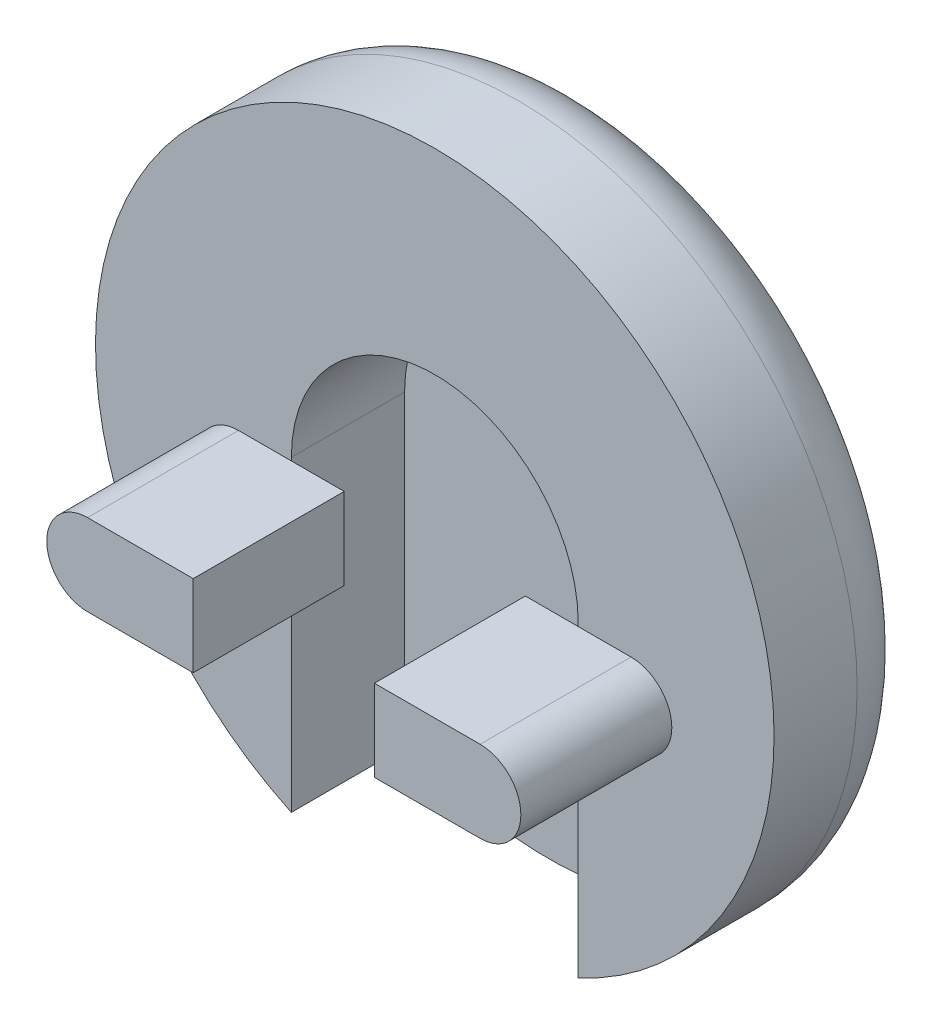
ISO-10303-21;
HEADER;
FILE_DESCRIPTION(('STEP AP214'),'2;1');
FILE_NAME('part.step','',(''),(''),'','','');
FILE_SCHEMA(('AUTOMOTIVE_DESIGN { 1 0 10303 214 1 1 1 1 }'));
ENDSEC;
DATA;
#1=APPLICATION_CONTEXT('core data for automotive mechanical design processes');
#2=APPLICATION_PROTOCOL_DEFINITION('international standard','automotive_design',2000,#1);
#3=PRODUCT_CONTEXT('',#1,'mechanical');
#4=PRODUCT('Part','Part','',(#3));
#5=PRODUCT_RELATED_PRODUCT_CATEGORY('part','',(#4));
#6=PRODUCT_DEFINITION_FORMATION('','',#4);
#7=PRODUCT_DEFINITION_CONTEXT('part definition',#1,'design');
#8=PRODUCT_DEFINITION('design','',#6,#7);
#9=PRODUCT_DEFINITION_SHAPE('','',#8);
#10=(LENGTH_UNIT() NAMED_UNIT(*) SI_UNIT(.MILLI.,.METRE.));
#11=(NAMED_UNIT(*) PLANE_ANGLE_UNIT() SI_UNIT($,.RADIAN.));
#12=(NAMED_UNIT(*) SI_UNIT($,.STERADIAN.) SOLID_ANGLE_UNIT());
#13=UNCERTAINTY_MEASURE_WITH_UNIT(LENGTH_MEASURE(1.E-05),#10,'distance_accuracy_value','');
#14=(GEOMETRIC_REPRESENTATION_CONTEXT(3) GLOBAL_UNCERTAINTY_ASSIGNED_CONTEXT((#13)) GLOBAL_UNIT_ASSIGNED_CONTEXT((#10,
#11,#12)) REPRESENTATION_CONTEXT('',''));
#15=CARTESIAN_POINT('',(0.,0.,0.));
#16=DIRECTION('',(0.,0.,1.));
#17=DIRECTION('',(1.,0.,0.));
#18=AXIS2_PLACEMENT_3D('',#15,#16,#17);
#19=CARTESIAN_POINT('',(0.534641806206758,0.935623160861775,2.54));
#20=DIRECTION('',(0.,0.,1.));
#21=DIRECTION('',(1.,0.,0.));
#22=AXIS2_PLACEMENT_3D('',#19,#20,#21);
#23=PLANE('',#22);
#24=CARTESIAN_POINT('',(3.83664180620676,0.197068843132637,2.54));
#25=DIRECTION('',(0.,0.,1.));
#26=DIRECTION('',(1.,0.,0.));
#27=AXIS2_PLACEMENT_3D('',#24,#25,#26);
#28=CIRCLE('',#27,0.6858);
#29=CARTESIAN_POINT('',(3.83664180620676,-0.488731156867363,2.54));
#30=VERTEX_POINT('',#29);
#31=CARTESIAN_POINT('',(3.83664180620676,0.882868843132637,2.54));
#32=VERTEX_POINT('',#31);
#33=EDGE_CURVE('E299',#30,#32,#28,.T.);
#34=ORIENTED_EDGE('',*,*,#33,.F.);
#35=DIRECTION('',(1.,0.,0.));
#36=VECTOR('',#35,1.);
#37=CARTESIAN_POINT('',(2.05864180620676,-0.488731156867363,2.54));
#38=LINE('',#37,#36);
#39=CARTESIAN_POINT('',(2.94764180620676,-0.488731156867363,2.54));
#40=VERTEX_POINT('',#39);
#41=EDGE_CURVE('E300',#40,#30,#38,.T.);
#42=ORIENTED_EDGE('',*,*,#41,.F.);
#43=DIRECTION('',(0.,1.,0.));
#44=VECTOR('',#43,1.);
#45=CARTESIAN_POINT('',(2.94764180620676,0.,2.54));
#46=LINE('',#45,#44);
#47=CARTESIAN_POINT('',(2.94764180620676,-4.23745744263961,2.54));
#48=VERTEX_POINT('',#47);
#49=EDGE_CURVE('E221',#48,#40,#46,.T.);
#50=ORIENTED_EDGE('',*,*,#49,.F.);
#51=CARTESIAN_POINT('',(0.534641806206758,0.935623160861775,2.54));
#52=DIRECTION('',(0.,0.,1.));
#53=DIRECTION('',(1.,0.,0.));
#54=AXIS2_PLACEMENT_3D('',#51,#52,#53);
#55=CIRCLE('',#54,5.70818114028648);
#56=CARTESIAN_POINT('',(-1.87835819379324,-4.23745744263961,2.54));
#57=VERTEX_POINT('',#56);
#58=EDGE_CURVE('E234',#48,#57,#55,.T.);
#59=ORIENTED_EDGE('',*,*,#58,.T.);
#60=DIRECTION('',(0.,1.,0.));
#61=VECTOR('',#60,1.);
#62=CARTESIAN_POINT('',(-1.87835819379324,0.,2.54));
#63=LINE('',#62,#61);
#64=CARTESIAN_POINT('',(-1.87835819379324,-0.48873115686736,2.54));
#65=VERTEX_POINT('',#64);
#66=EDGE_CURVE('E215',#57,#65,#63,.T.);
#67=ORIENTED_EDGE('',*,*,#66,.T.);
#68=DIRECTION('',(1.,0.,0.));
#69=VECTOR('',#68,1.);
#70=CARTESIAN_POINT('',(-2.76735819379324,-0.48873115686736,2.54));
#71=LINE('',#70,#69);
#72=CARTESIAN_POINT('',(-2.76735819379324,-0.48873115686736,2.54));
#73=VERTEX_POINT('',#72);
#74=EDGE_CURVE('E184',#73,#65,#71,.T.);
#75=ORIENTED_EDGE('',*,*,#74,.F.);
#76=CARTESIAN_POINT('',(-2.76735819379324,0.19706884313264,2.54));
#77=DIRECTION('',(0.,0.,1.));
#78=DIRECTION('',(1.,0.,0.));
#79=AXIS2_PLACEMENT_3D('',#76,#77,#78);
#80=CIRCLE('',#79,0.6858);
#81=CARTESIAN_POINT('',(-2.76735819379324,0.88286884313264,2.54));
#82=VERTEX_POINT('',#81);
#83=EDGE_CURVE('E193',#82,#73,#80,.T.);
#84=ORIENTED_EDGE('',*,*,#83,.F.);
#85=DIRECTION('',(-1.,0.,0.));
#86=VECTOR('',#85,1.);
#87=CARTESIAN_POINT('',(-0.989358193793241,0.88286884313264,2.54));
#88=LINE('',#87,#86);
#89=CARTESIAN_POINT('',(-1.87835819379324,0.88286884313264,2.54));
#90=VERTEX_POINT('',#89);
#91=EDGE_CURVE('E194',#90,#82,#88,.T.);
#92=ORIENTED_EDGE('',*,*,#91,.F.);
#93=CARTESIAN_POINT('',(-1.87835819379324,0.935623160861775,2.54));
#94=VERTEX_POINT('',#93);
#95=EDGE_CURVE('E228',#90,#94,#63,.T.);
#96=ORIENTED_EDGE('',*,*,#95,.T.);
#97=CARTESIAN_POINT('',(0.534641806206758,0.935623160861775,2.54));
#98=DIRECTION('',(0.,0.,1.));
#99=DIRECTION('',(1.,0.,0.));
#100=AXIS2_PLACEMENT_3D('',#97,#98,#99);
#101=CIRCLE('',#100,2.413);
#102=CARTESIAN_POINT('',(2.94764180620676,0.935623160861775,2.54));
#103=VERTEX_POINT('',#102);
#104=EDGE_CURVE('E224',#103,#94,#101,.T.);
#105=ORIENTED_EDGE('',*,*,#104,.F.);
#106=CARTESIAN_POINT('',(2.94764180620676,0.882868843132637,2.54));
#107=VERTEX_POINT('',#106);
#108=EDGE_CURVE('E211',#107,#103,#46,.T.);
#109=ORIENTED_EDGE('',*,*,#108,.F.);
#110=DIRECTION('',(-1.,0.,0.));
#111=VECTOR('',#110,1.);
#112=CARTESIAN_POINT('',(2.05864180620676,0.882868843132637,2.54));
#113=LINE('',#112,#111);
#114=EDGE_CURVE('E166',#32,#107,#113,.T.);
#115=ORIENTED_EDGE('',*,*,#114,.F.);
#116=EDGE_LOOP('',(#34,#42,#50,#59,#67,#75,#84,#92,#96,#105,#109,#115));
#117=FACE_BOUND('',#116,.T.);
#118=ADVANCED_FACE('F37',(#117),#23,.T.);
#119=CARTESIAN_POINT('',(0.534641806206758,0.935623160861775,2.54));
#120=DIRECTION('',(0.,0.,-1.));
#121=DIRECTION('',(-1.,0.,0.));
#122=AXIS2_PLACEMENT_3D('',#119,#120,#121);
#123=CYLINDRICAL_SURFACE('',#122,5.70818114028648);
#124=DIRECTION('',(0.,0.,1.));
#125=VECTOR('',#124,1.);
#126=CARTESIAN_POINT('',(2.94764180620676,-4.23745744263961,0.635));
#127=LINE('',#126,#125);
#128=CARTESIAN_POINT('',(2.94764180620676,-4.23745744263961,1.143));
#129=VERTEX_POINT('',#128);
#130=EDGE_CURVE('E232',#129,#48,#127,.T.);
#131=ORIENTED_EDGE('',*,*,#130,.F.);
#132=CARTESIAN_POINT('',(0.534641806206758,0.935623160861775,1.143));
#133=DIRECTION('',(0.,0.,1.));
#134=DIRECTION('',(1.,0.,0.));
#135=AXIS2_PLACEMENT_3D('',#132,#133,#134);
#136=CIRCLE('',#135,5.70818114028648);
#137=CARTESIAN_POINT('',(-1.87835819379324,-4.23745744263961,1.143));
#138=VERTEX_POINT('',#137);
#139=EDGE_CURVE('E244',#129,#138,#136,.T.);
#140=ORIENTED_EDGE('',*,*,#139,.T.);
#141=DIRECTION('',(0.,0.,1.));
#142=VECTOR('',#141,1.);
#143=CARTESIAN_POINT('',(-1.87835819379324,-4.23745744263961,0.635));
#144=LINE('',#143,#142);
#145=EDGE_CURVE('E235',#138,#57,#144,.T.);
#146=ORIENTED_EDGE('',*,*,#145,.T.);
#147=ORIENTED_EDGE('',*,*,#58,.F.);
#148=EDGE_LOOP('',(#131,#140,#146,#147));
#149=FACE_BOUND('',#148,.T.);
#150=ADVANCED_FACE('F281',(#149),#123,.T.);
#151=CARTESIAN_POINT('',(0.534641806206758,0.935623160861775,0.));
#152=DIRECTION('',(0.,0.,1.));
#153=DIRECTION('',(1.,0.,0.));
#154=AXIS2_PLACEMENT_3D('',#151,#152,#153);
#155=PLANE('',#154);
#156=CARTESIAN_POINT('',(0.534641806206758,0.935623160861775,0.));
#157=DIRECTION('',(0.,0.,1.));
#158=DIRECTION('',(1.,0.,0.));
#159=AXIS2_PLACEMENT_3D('',#156,#157,#158);
#160=CIRCLE('',#159,4.56518114028648);
#161=CARTESIAN_POINT('',(5.09982294649324,0.935623160861775,0.));
#162=VERTEX_POINT('',#161);
#163=EDGE_CURVE('E12',#162,#162,#160,.F.);
#164=ORIENTED_EDGE('',*,*,#163,.T.);
#165=EDGE_LOOP('',(#164));
#166=FACE_BOUND('',#165,.T.);
#167=ADVANCED_FACE('F267',(#166),#155,.F.);
#168=CARTESIAN_POINT('',(2.94764180620676,0.,0.635));
#169=DIRECTION('',(1.,0.,0.));
#170=DIRECTION('',(0.,0.,-1.));
#171=AXIS2_PLACEMENT_3D('',#168,#169,#170);
#172=PLANE('',#171);
#173=DIRECTION('',(0.,1.,0.));
#174=VECTOR('',#173,1.);
#175=CARTESIAN_POINT('',(2.94764180620676,0.,0.635));
#176=LINE('',#175,#174);
#177=CARTESIAN_POINT('',(2.94764180620676,-4.10573918148928,0.635));
#178=VERTEX_POINT('',#177);
#179=CARTESIAN_POINT('',(2.94764180620676,0.935623160861775,0.635));
#180=VERTEX_POINT('',#179);
#181=EDGE_CURVE('E212',#178,#180,#176,.T.);
#182=ORIENTED_EDGE('',*,*,#181,.F.);
#183=CARTESIAN_POINT('',(2.94764180620676,-4.10573918148928,0.635));
#184=CARTESIAN_POINT('',(2.94764180620676,-4.12018182209151,0.66125917941811));
#185=CARTESIAN_POINT('',(2.94764180620676,-4.13353671551341,0.688098257732688));
#186=CARTESIAN_POINT('',(2.94764180620676,-4.15796868166917,0.742811190824336));
#187=CARTESIAN_POINT('',(2.94764180620676,-4.16904448195041,0.77068561345363));
#188=CARTESIAN_POINT('',(2.94764180620676,-4.19824182968764,0.854381254054029));
#189=CARTESIAN_POINT('',(2.94764180620676,-4.21297758116857,0.91144603978596));
#190=CARTESIAN_POINT('',(2.94764180620676,-4.22764834976591,0.997813191966427));
#191=CARTESIAN_POINT('',(2.94764180620676,-4.23129961097129,1.02654129878058));
#192=CARTESIAN_POINT('',(2.94764180620676,-4.2362166303214,1.08450513744778));
#193=CARTESIAN_POINT('',(2.94764180620676,-4.23745690795823,1.11374303091327));
#194=CARTESIAN_POINT('',(2.94764180620676,-4.23745744263961,1.143));
#195=B_SPLINE_CURVE_WITH_KNOTS('',3,(#183,#184,#185,#186,#187,#188,#189,#190,#191,#192,#193,
#194),.UNSPECIFIED.,.F.,.F.,(4,2,2,2,2,4),(0.,0.0898473539475477,0.179744735751891,
0.355577383247332,0.442371889098987,0.530078800916125),.UNSPECIFIED.);
#196=EDGE_CURVE('E46',#178,#129,#195,.T.);
#197=ORIENTED_EDGE('',*,*,#196,.T.);
#198=ORIENTED_EDGE('',*,*,#130,.T.);
#199=ORIENTED_EDGE('',*,*,#49,.T.);
#200=EDGE_CURVE('E225',#40,#107,#46,.T.);
#201=ORIENTED_EDGE('',*,*,#200,.T.);
#202=ORIENTED_EDGE('',*,*,#108,.T.);
#203=DIRECTION('',(0.,0.,1.));
#204=VECTOR('',#203,1.);
#205=CARTESIAN_POINT('',(2.94764180620676,0.935623160861775,0.635));
#206=LINE('',#205,#204);
#207=EDGE_CURVE('E220',#180,#103,#206,.T.);
#208=ORIENTED_EDGE('',*,*,#207,.F.);
#209=EDGE_LOOP('',(#182,#197,#198,#199,#201,#202,#208));
#210=FACE_BOUND('',#209,.T.);
#211=ADVANCED_FACE('F258',(#210),#172,.F.);
#212=CARTESIAN_POINT('',(-1.87835819379324,0.,0.635));
#213=DIRECTION('',(1.,0.,0.));
#214=DIRECTION('',(0.,0.,-1.));
#215=AXIS2_PLACEMENT_3D('',#212,#213,#214);
#216=PLANE('',#215);
#217=ORIENTED_EDGE('',*,*,#145,.F.);
#218=CARTESIAN_POINT('',(-1.87835819379324,-4.23745744263961,1.143));
#219=CARTESIAN_POINT('',(-1.87835819379324,-4.23745724658603,1.11303043220782));
#220=CARTESIAN_POINT('',(-1.87835819379324,-4.23615551072581,1.08308027739856));
#221=CARTESIAN_POINT('',(-1.87835819379324,-4.23096878084433,1.02339925972294));
#222=CARTESIAN_POINT('',(-1.87835819379324,-4.22708334417785,0.993668435315366));
#223=CARTESIAN_POINT('',(-1.87835819379324,-4.21180571407471,0.906370099767557));
#224=CARTESIAN_POINT('',(-1.87835819379324,-4.19678805012741,0.849382676705431));
#225=CARTESIAN_POINT('',(-1.87835819379324,-4.16752544589358,0.766801511388969));
#226=CARTESIAN_POINT('',(-1.87835819379324,-4.1567369846728,0.739917797942896));
#227=CARTESIAN_POINT('',(-1.87835819379324,-4.13290588864199,0.686832096109021));
#228=CARTESIAN_POINT('',(-1.87835819379324,-4.11984100155579,0.660640090584266));
#229=CARTESIAN_POINT('',(-1.87835819379324,-4.10573918148948,0.634999999999928));
#230=B_SPLINE_CURVE_WITH_KNOTS('',3,(#218,#219,#220,#221,#222,#223,#224,#225,#226,#227,#228,
#229),.UNSPECIFIED.,.F.,.F.,(4,2,2,2,2,4),(0.,0.0898421493365797,0.179699694591107,
0.355522620942395,0.442349720620996,0.530078784901483),.UNSPECIFIED.);
#231=CARTESIAN_POINT('',(-1.87835819379324,-4.10573918148928,0.635));
#232=VERTEX_POINT('',#231);
#233=EDGE_CURVE('E61',#138,#232,#230,.T.);
#234=ORIENTED_EDGE('',*,*,#233,.T.);
#235=DIRECTION('',(0.,1.,0.));
#236=VECTOR('',#235,1.);
#237=CARTESIAN_POINT('',(-1.87835819379324,0.,0.635));
#238=LINE('',#237,#236);
#239=CARTESIAN_POINT('',(-1.87835819379324,0.935623160861775,0.635));
#240=VERTEX_POINT('',#239);
#241=EDGE_CURVE('E218',#232,#240,#238,.T.);
#242=ORIENTED_EDGE('',*,*,#241,.T.);
#243=DIRECTION('',(0.,0.,1.));
#244=VECTOR('',#243,1.);
#245=CARTESIAN_POINT('',(-1.87835819379324,0.935623160861775,0.635));
#246=LINE('',#245,#244);
#247=EDGE_CURVE('E237',#240,#94,#246,.T.);
#248=ORIENTED_EDGE('',*,*,#247,.T.);
#249=ORIENTED_EDGE('',*,*,#95,.F.);
#250=EDGE_CURVE('E231',#65,#90,#63,.T.);
#251=ORIENTED_EDGE('',*,*,#250,.F.);
#252=ORIENTED_EDGE('',*,*,#66,.F.);
#253=EDGE_LOOP('',(#217,#234,#242,#248,#249,#251,#252));
#254=FACE_BOUND('',#253,.T.);
#255=ADVANCED_FACE('F252',(#254),#216,.T.);
#256=CARTESIAN_POINT('',(0.534641806206758,0.935623160861775,0.635));
#257=DIRECTION('',(0.,0.,1.));
#258=DIRECTION('',(1.,0.,0.));
#259=AXIS2_PLACEMENT_3D('',#256,#257,#258);
#260=CYLINDRICAL_SURFACE('',#259,2.413);
#261=ORIENTED_EDGE('',*,*,#104,.T.);
#262=ORIENTED_EDGE('',*,*,#247,.F.);
#263=CARTESIAN_POINT('',(0.534641806206758,0.935623160861775,0.635));
#264=DIRECTION('',(0.,0.,1.));
#265=DIRECTION('',(1.,0.,0.));
#266=AXIS2_PLACEMENT_3D('',#263,#264,#265);
#267=CIRCLE('',#266,2.413);
#268=EDGE_CURVE('E214',#180,#240,#267,.T.);
#269=ORIENTED_EDGE('',*,*,#268,.F.);
#270=ORIENTED_EDGE('',*,*,#207,.T.);
#271=EDGE_LOOP('',(#261,#262,#269,#270));
#272=FACE_BOUND('',#271,.T.);
#273=ADVANCED_FACE('F257',(#272),#260,.F.);
#274=CARTESIAN_POINT('',(0.,0.,0.635));
#275=DIRECTION('',(0.,0.,1.));
#276=DIRECTION('',(1.,0.,0.));
#277=AXIS2_PLACEMENT_3D('',#274,#275,#276);
#278=PLANE('',#277);
#279=ORIENTED_EDGE('',*,*,#241,.F.);
#280=CARTESIAN_POINT('',(0.534641806206758,0.935623160861775,0.635));
#281=DIRECTION('',(0.,0.,1.));
#282=DIRECTION('',(1.,0.,0.));
#283=AXIS2_PLACEMENT_3D('',#280,#281,#282);
#284=CIRCLE('',#283,5.58908787432039);
#285=EDGE_CURVE('E53',#232,#178,#284,.T.);
#286=ORIENTED_EDGE('',*,*,#285,.T.);
#287=ORIENTED_EDGE('',*,*,#181,.T.);
#288=ORIENTED_EDGE('',*,*,#268,.T.);
#289=EDGE_LOOP('',(#279,#286,#287,#288));
#290=FACE_BOUND('',#289,.T.);
#291=ADVANCED_FACE('F259',(#290),#278,.T.);
#292=CARTESIAN_POINT('',(-2.76735819379324,0.19706884313264,2.54));
#293=DIRECTION('',(0.,0.,1.));
#294=DIRECTION('',(1.,0.,0.));
#295=AXIS2_PLACEMENT_3D('',#292,#293,#294);
#296=PLANE('',#295);
#297=CARTESIAN_POINT('',(-0.989358193793241,-0.48873115686736,2.54));
#298=VERTEX_POINT('',#297);
#299=EDGE_CURVE('E197',#65,#298,#71,.T.);
#300=ORIENTED_EDGE('',*,*,#299,.F.);
#301=ORIENTED_EDGE('',*,*,#250,.T.);
#302=CARTESIAN_POINT('',(-0.989358193793241,0.88286884313264,2.54));
#303=VERTEX_POINT('',#302);
#304=EDGE_CURVE('E174',#303,#90,#88,.T.);
#305=ORIENTED_EDGE('',*,*,#304,.F.);
#306=DIRECTION('',(0.,1.,0.));
#307=VECTOR('',#306,1.);
#308=CARTESIAN_POINT('',(-0.989358193793241,0.88286884313264,2.54));
#309=LINE('',#308,#307);
#310=EDGE_CURVE('E171',#298,#303,#309,.T.);
#311=ORIENTED_EDGE('',*,*,#310,.F.);
#312=EDGE_LOOP('',(#300,#301,#305,#311));
#313=FACE_BOUND('',#312,.T.);
#314=ADVANCED_FACE('F328',(#313),#296,.F.);
#315=CARTESIAN_POINT('',(-0.989358193793241,0.88286884313264,5.08));
#316=DIRECTION('',(-1.,0.,0.));
#317=DIRECTION('',(0.,-1.,0.));
#318=AXIS2_PLACEMENT_3D('',#315,#316,#317);
#319=PLANE('',#318);
#320=ORIENTED_EDGE('',*,*,#310,.T.);
#321=DIRECTION('',(0.,0.,-1.));
#322=VECTOR('',#321,1.);
#323=CARTESIAN_POINT('',(-0.989358193793241,0.88286884313264,5.08));
#324=LINE('',#323,#322);
#325=CARTESIAN_POINT('',(-0.989358193793241,0.88286884313264,5.08));
#326=VERTEX_POINT('',#325);
#327=EDGE_CURVE('E208',#326,#303,#324,.T.);
#328=ORIENTED_EDGE('',*,*,#327,.F.);
#329=DIRECTION('',(0.,1.,0.));
#330=VECTOR('',#329,1.);
#331=CARTESIAN_POINT('',(-0.989358193793241,0.88286884313264,5.08));
#332=LINE('',#331,#330);
#333=CARTESIAN_POINT('',(-0.989358193793241,-0.48873115686736,5.08));
#334=VERTEX_POINT('',#333);
#335=EDGE_CURVE('E180',#334,#326,#332,.T.);
#336=ORIENTED_EDGE('',*,*,#335,.F.);
#337=DIRECTION('',(0.,0.,-1.));
#338=VECTOR('',#337,1.);
#339=CARTESIAN_POINT('',(-0.989358193793241,-0.48873115686736,5.08));
#340=LINE('',#339,#338);
#341=EDGE_CURVE('E189',#334,#298,#340,.T.);
#342=ORIENTED_EDGE('',*,*,#341,.T.);
#343=EDGE_LOOP('',(#320,#328,#336,#342));
#344=FACE_BOUND('',#343,.T.);
#345=ADVANCED_FACE('F332',(#344),#319,.F.);
#346=CARTESIAN_POINT('',(-0.989358193793241,0.88286884313264,5.08));
#347=DIRECTION('',(0.,-1.,0.));
#348=DIRECTION('',(1.,0.,0.));
#349=AXIS2_PLACEMENT_3D('',#346,#347,#348);
#350=PLANE('',#349);
#351=ORIENTED_EDGE('',*,*,#304,.T.);
#352=ORIENTED_EDGE('',*,*,#91,.T.);
#353=DIRECTION('',(0.,0.,-1.));
#354=VECTOR('',#353,1.);
#355=CARTESIAN_POINT('',(-2.76735819379324,0.88286884313264,5.08));
#356=LINE('',#355,#354);
#357=CARTESIAN_POINT('',(-2.76735819379324,0.88286884313264,5.08));
#358=VERTEX_POINT('',#357);
#359=EDGE_CURVE('E205',#358,#82,#356,.T.);
#360=ORIENTED_EDGE('',*,*,#359,.F.);
#361=DIRECTION('',(-1.,0.,0.));
#362=VECTOR('',#361,1.);
#363=CARTESIAN_POINT('',(-0.989358193793241,0.88286884313264,5.08));
#364=LINE('',#363,#362);
#365=EDGE_CURVE('E183',#326,#358,#364,.T.);
#366=ORIENTED_EDGE('',*,*,#365,.F.);
#367=ORIENTED_EDGE('',*,*,#327,.T.);
#368=EDGE_LOOP('',(#351,#352,#360,#366,#367));
#369=FACE_BOUND('',#368,.T.);
#370=ADVANCED_FACE('F338',(#369),#350,.F.);
#371=CARTESIAN_POINT('',(-2.76735819379324,0.19706884313264,5.08));
#372=DIRECTION('',(0.,0.,-1.));
#373=DIRECTION('',(-1.,0.,0.));
#374=AXIS2_PLACEMENT_3D('',#371,#372,#373);
#375=CYLINDRICAL_SURFACE('',#374,0.6858);
#376=ORIENTED_EDGE('',*,*,#83,.T.);
#377=DIRECTION('',(0.,0.,-1.));
#378=VECTOR('',#377,1.);
#379=CARTESIAN_POINT('',(-2.76735819379324,-0.48873115686736,5.08));
#380=LINE('',#379,#378);
#381=CARTESIAN_POINT('',(-2.76735819379324,-0.48873115686736,5.08));
#382=VERTEX_POINT('',#381);
#383=EDGE_CURVE('E202',#382,#73,#380,.T.);
#384=ORIENTED_EDGE('',*,*,#383,.F.);
#385=CARTESIAN_POINT('',(-2.76735819379324,0.19706884313264,5.08));
#386=DIRECTION('',(0.,0.,1.));
#387=DIRECTION('',(1.,0.,0.));
#388=AXIS2_PLACEMENT_3D('',#385,#386,#387);
#389=CIRCLE('',#388,0.6858);
#390=EDGE_CURVE('E186',#358,#382,#389,.T.);
#391=ORIENTED_EDGE('',*,*,#390,.F.);
#392=ORIENTED_EDGE('',*,*,#359,.T.);
#393=EDGE_LOOP('',(#376,#384,#391,#392));
#394=FACE_BOUND('',#393,.T.);
#395=ADVANCED_FACE('F348',(#394),#375,.T.);
#396=CARTESIAN_POINT('',(-2.76735819379324,-0.48873115686736,5.08));
#397=DIRECTION('',(0.,1.,0.));
#398=DIRECTION('',(0.,0.,1.));
#399=AXIS2_PLACEMENT_3D('',#396,#397,#398);
#400=PLANE('',#399);
#401=ORIENTED_EDGE('',*,*,#74,.T.);
#402=ORIENTED_EDGE('',*,*,#299,.T.);
#403=ORIENTED_EDGE('',*,*,#341,.F.);
#404=DIRECTION('',(1.,0.,0.));
#405=VECTOR('',#404,1.);
#406=CARTESIAN_POINT('',(-2.76735819379324,-0.48873115686736,5.08));
#407=LINE('',#406,#405);
#408=EDGE_CURVE('E188',#382,#334,#407,.T.);
#409=ORIENTED_EDGE('',*,*,#408,.F.);
#410=ORIENTED_EDGE('',*,*,#383,.T.);
#411=EDGE_LOOP('',(#401,#402,#403,#409,#410));
#412=FACE_BOUND('',#411,.T.);
#413=ADVANCED_FACE('F345',(#412),#400,.F.);
#414=CARTESIAN_POINT('',(-2.76735819379324,0.19706884313264,5.08));
#415=DIRECTION('',(0.,0.,1.));
#416=DIRECTION('',(1.,0.,0.));
#417=AXIS2_PLACEMENT_3D('',#414,#415,#416);
#418=PLANE('',#417);
#419=ORIENTED_EDGE('',*,*,#335,.T.);
#420=ORIENTED_EDGE('',*,*,#365,.T.);
#421=ORIENTED_EDGE('',*,*,#390,.T.);
#422=ORIENTED_EDGE('',*,*,#408,.T.);
#423=EDGE_LOOP('',(#419,#420,#421,#422));
#424=FACE_BOUND('',#423,.T.);
#425=ADVANCED_FACE('F343',(#424),#418,.T.);
#426=CARTESIAN_POINT('',(3.83664180620676,0.197068843132637,2.54));
#427=DIRECTION('',(0.,0.,1.));
#428=DIRECTION('',(1.,0.,0.));
#429=AXIS2_PLACEMENT_3D('',#426,#427,#428);
#430=PLANE('',#429);
#431=CARTESIAN_POINT('',(2.05864180620676,0.882868843132637,2.54));
#432=VERTEX_POINT('',#431);
#433=EDGE_CURVE('E305',#107,#432,#113,.T.);
#434=ORIENTED_EDGE('',*,*,#433,.F.);
#435=ORIENTED_EDGE('',*,*,#200,.F.);
#436=CARTESIAN_POINT('',(2.05864180620676,-0.488731156867363,2.54));
#437=VERTEX_POINT('',#436);
#438=EDGE_CURVE('E306',#437,#40,#38,.T.);
#439=ORIENTED_EDGE('',*,*,#438,.F.);
#440=DIRECTION('',(0.,-1.,0.));
#441=VECTOR('',#440,1.);
#442=CARTESIAN_POINT('',(2.05864180620676,0.882868843132637,2.54));
#443=LINE('',#442,#441);
#444=EDGE_CURVE('E170',#432,#437,#443,.T.);
#445=ORIENTED_EDGE('',*,*,#444,.F.);
#446=EDGE_LOOP('',(#434,#435,#439,#445));
#447=FACE_BOUND('',#446,.T.);
#448=ADVANCED_FACE('F319',(#447),#430,.F.);
#449=CARTESIAN_POINT('',(2.05864180620676,0.882868843132637,5.08));
#450=DIRECTION('',(1.,0.,0.));
#451=DIRECTION('',(0.,0.,-1.));
#452=AXIS2_PLACEMENT_3D('',#449,#450,#451);
#453=PLANE('',#452);
#454=ORIENTED_EDGE('',*,*,#444,.T.);
#455=DIRECTION('',(0.,0.,-1.));
#456=VECTOR('',#455,1.);
#457=CARTESIAN_POINT('',(2.05864180620676,-0.488731156867363,5.08));
#458=LINE('',#457,#456);
#459=CARTESIAN_POINT('',(2.05864180620676,-0.488731156867363,5.08));
#460=VERTEX_POINT('',#459);
#461=EDGE_CURVE('E150',#460,#437,#458,.T.);
#462=ORIENTED_EDGE('',*,*,#461,.F.);
#463=DIRECTION('',(0.,-1.,0.));
#464=VECTOR('',#463,1.);
#465=CARTESIAN_POINT('',(2.05864180620676,0.882868843132637,5.08));
#466=LINE('',#465,#464);
#467=CARTESIAN_POINT('',(2.05864180620676,0.882868843132637,5.08));
#468=VERTEX_POINT('',#467);
#469=EDGE_CURVE('E157',#468,#460,#466,.T.);
#470=ORIENTED_EDGE('',*,*,#469,.F.);
#471=DIRECTION('',(0.,0.,-1.));
#472=VECTOR('',#471,1.);
#473=CARTESIAN_POINT('',(2.05864180620676,0.882868843132637,5.08));
#474=LINE('',#473,#472);
#475=EDGE_CURVE('E312',#468,#432,#474,.T.);
#476=ORIENTED_EDGE('',*,*,#475,.T.);
#477=EDGE_LOOP('',(#454,#462,#470,#476));
#478=FACE_BOUND('',#477,.T.);
#479=ADVANCED_FACE('F168',(#478),#453,.F.);
#480=CARTESIAN_POINT('',(2.05864180620676,-0.488731156867363,5.08));
#481=DIRECTION('',(0.,1.,0.));
#482=DIRECTION('',(0.,0.,1.));
#483=AXIS2_PLACEMENT_3D('',#480,#481,#482);
#484=PLANE('',#483);
#485=ORIENTED_EDGE('',*,*,#438,.T.);
#486=ORIENTED_EDGE('',*,*,#41,.T.);
#487=DIRECTION('',(0.,0.,-1.));
#488=VECTOR('',#487,1.);
#489=CARTESIAN_POINT('',(3.83664180620676,-0.488731156867363,5.08));
#490=LINE('',#489,#488);
#491=CARTESIAN_POINT('',(3.83664180620676,-0.488731156867363,5.08));
#492=VERTEX_POINT('',#491);
#493=EDGE_CURVE('E153',#492,#30,#490,.T.);
#494=ORIENTED_EDGE('',*,*,#493,.F.);
#495=DIRECTION('',(1.,0.,0.));
#496=VECTOR('',#495,1.);
#497=CARTESIAN_POINT('',(2.05864180620676,-0.488731156867363,5.08));
#498=LINE('',#497,#496);
#499=EDGE_CURVE('E145',#460,#492,#498,.T.);
#500=ORIENTED_EDGE('',*,*,#499,.F.);
#501=ORIENTED_EDGE('',*,*,#461,.T.);
#502=EDGE_LOOP('',(#485,#486,#494,#500,#501));
#503=FACE_BOUND('',#502,.T.);
#504=ADVANCED_FACE('F148',(#503),#484,.F.);
#505=CARTESIAN_POINT('',(3.83664180620676,0.197068843132637,5.08));
#506=DIRECTION('',(0.,0.,-1.));
#507=DIRECTION('',(-1.,0.,0.));
#508=AXIS2_PLACEMENT_3D('',#505,#506,#507);
#509=CYLINDRICAL_SURFACE('',#508,0.6858);
#510=ORIENTED_EDGE('',*,*,#33,.T.);
#511=DIRECTION('',(0.,0.,-1.));
#512=VECTOR('',#511,1.);
#513=CARTESIAN_POINT('',(3.83664180620676,0.882868843132637,5.08));
#514=LINE('',#513,#512);
#515=CARTESIAN_POINT('',(3.83664180620676,0.882868843132637,5.08));
#516=VERTEX_POINT('',#515);
#517=EDGE_CURVE('E176',#516,#32,#514,.T.);
#518=ORIENTED_EDGE('',*,*,#517,.F.);
#519=CARTESIAN_POINT('',(3.83664180620676,0.197068843132637,5.08));
#520=DIRECTION('',(0.,0.,1.));
#521=DIRECTION('',(1.,0.,0.));
#522=AXIS2_PLACEMENT_3D('',#519,#520,#521);
#523=CIRCLE('',#522,0.6858);
#524=EDGE_CURVE('E156',#492,#516,#523,.T.);
#525=ORIENTED_EDGE('',*,*,#524,.F.);
#526=ORIENTED_EDGE('',*,*,#493,.T.);
#527=EDGE_LOOP('',(#510,#518,#525,#526));
#528=FACE_BOUND('',#527,.T.);
#529=ADVANCED_FACE('F315',(#528),#509,.T.);
#530=CARTESIAN_POINT('',(2.05864180620676,0.882868843132637,5.08));
#531=DIRECTION('',(0.,-1.,0.));
#532=DIRECTION('',(0.,0.,-1.));
#533=AXIS2_PLACEMENT_3D('',#530,#531,#532);
#534=PLANE('',#533);
#535=ORIENTED_EDGE('',*,*,#114,.T.);
#536=ORIENTED_EDGE('',*,*,#433,.T.);
#537=ORIENTED_EDGE('',*,*,#475,.F.);
#538=DIRECTION('',(-1.,0.,0.));
#539=VECTOR('',#538,1.);
#540=CARTESIAN_POINT('',(2.05864180620676,0.882868843132637,5.08));
#541=LINE('',#540,#539);
#542=EDGE_CURVE('E162',#516,#468,#541,.T.);
#543=ORIENTED_EDGE('',*,*,#542,.F.);
#544=ORIENTED_EDGE('',*,*,#517,.T.);
#545=EDGE_LOOP('',(#535,#536,#537,#543,#544));
#546=FACE_BOUND('',#545,.T.);
#547=ADVANCED_FACE('F287',(#546),#534,.F.);
#548=CARTESIAN_POINT('',(3.83664180620676,0.197068843132637,5.08));
#549=DIRECTION('',(0.,0.,1.));
#550=DIRECTION('',(1.,0.,0.));
#551=AXIS2_PLACEMENT_3D('',#548,#549,#550);
#552=PLANE('',#551);
#553=ORIENTED_EDGE('',*,*,#469,.T.);
#554=ORIENTED_EDGE('',*,*,#499,.T.);
#555=ORIENTED_EDGE('',*,*,#524,.T.);
#556=ORIENTED_EDGE('',*,*,#542,.T.);
#557=EDGE_LOOP('',(#553,#554,#555,#556));
#558=FACE_BOUND('',#557,.T.);
#559=ADVANCED_FACE('F160',(#558),#552,.T.);
#560=CARTESIAN_POINT('',(0.534641806206758,0.935623160861775,1.143));
#561=DIRECTION('',(0.,0.,1.));
#562=DIRECTION('',(1.,0.,0.));
#563=AXIS2_PLACEMENT_3D('',#560,#561,#562);
#564=TOROIDAL_SURFACE('',#563,4.56518114028648,1.143);
#565=ORIENTED_EDGE('',*,*,#163,.F.);
#566=EDGE_LOOP('',(#565));
#567=FACE_BOUND('',#566,.T.);
#568=ORIENTED_EDGE('',*,*,#233,.F.);
#569=ORIENTED_EDGE('',*,*,#139,.F.);
#570=ORIENTED_EDGE('',*,*,#196,.F.);
#571=ORIENTED_EDGE('',*,*,#285,.F.);
#572=EDGE_LOOP('',(#568,#569,#570,#571));
#573=FACE_BOUND('',#572,.T.);
#574=ADVANCED_FACE('F39',(#567,#573),#564,.T.);
#575=CLOSED_SHELL('',(#118,#150,#167,#211,#255,#273,#291,#314,#345,#370,#395,#413,#425,#448,
#479,#504,#529,#547,#559,#574));
#576=MANIFOLD_SOLID_BREP('B2',#575);
#577=ADVANCED_BREP_SHAPE_REPRESENTATION('',(#18,#576),#14);
#578=SHAPE_DEFINITION_REPRESENTATION(#9,#577);
ENDSEC;
END-ISO-10303-21;
